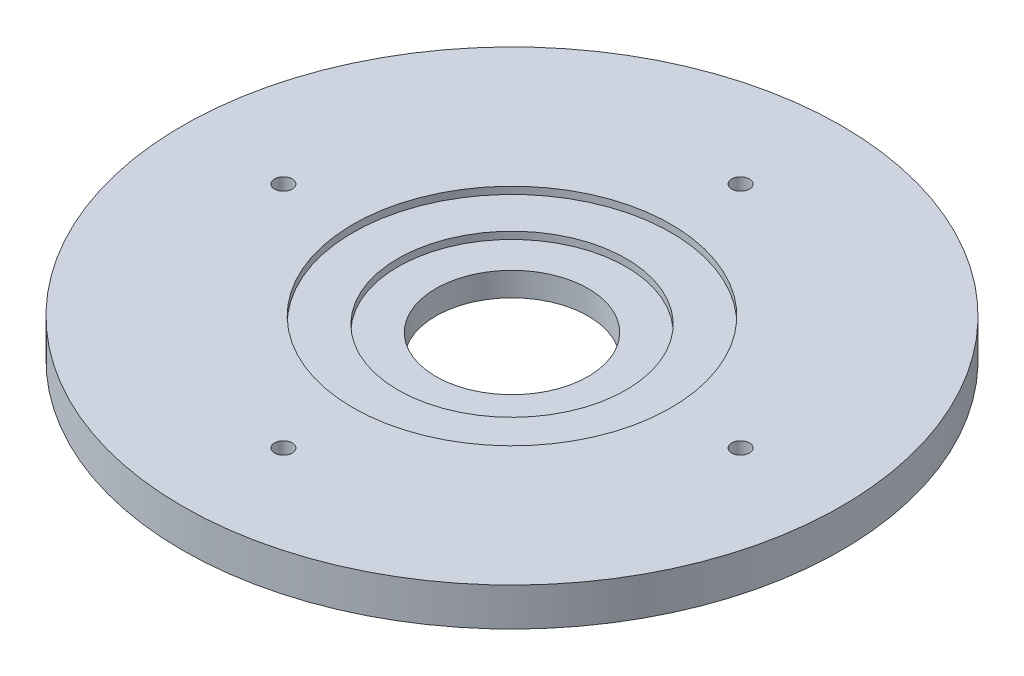
ISO-10303-21;
HEADER;
FILE_DESCRIPTION(('STEP AP214'),'2;1');
FILE_NAME('part.step','',(''),(''),'','','');
FILE_SCHEMA(('AUTOMOTIVE_DESIGN { 1 0 10303 214 1 1 1 1 }'));
ENDSEC;
DATA;
#1=APPLICATION_CONTEXT('core data for automotive mechanical design processes');
#2=APPLICATION_PROTOCOL_DEFINITION('international standard','automotive_design',2000,#1);
#3=PRODUCT_CONTEXT('',#1,'mechanical');
#4=PRODUCT('Part','Part','',(#3));
#5=PRODUCT_RELATED_PRODUCT_CATEGORY('part','',(#4));
#6=PRODUCT_DEFINITION_FORMATION('','',#4);
#7=PRODUCT_DEFINITION_CONTEXT('part definition',#1,'design');
#8=PRODUCT_DEFINITION('design','',#6,#7);
#9=PRODUCT_DEFINITION_SHAPE('','',#8);
#10=(LENGTH_UNIT() NAMED_UNIT(*) SI_UNIT(.MILLI.,.METRE.));
#11=(NAMED_UNIT(*) PLANE_ANGLE_UNIT() SI_UNIT($,.RADIAN.));
#12=(NAMED_UNIT(*) SI_UNIT($,.STERADIAN.) SOLID_ANGLE_UNIT());
#13=UNCERTAINTY_MEASURE_WITH_UNIT(LENGTH_MEASURE(1.E-05),#10,'distance_accuracy_value','');
#14=(GEOMETRIC_REPRESENTATION_CONTEXT(3) GLOBAL_UNCERTAINTY_ASSIGNED_CONTEXT((#13)) GLOBAL_UNIT_ASSIGNED_CONTEXT((#10,
#11,#12)) REPRESENTATION_CONTEXT('',''));
#15=CARTESIAN_POINT('',(0.,0.,0.));
#16=DIRECTION('',(0.,0.,1.));
#17=DIRECTION('',(1.,0.,0.));
#18=AXIS2_PLACEMENT_3D('',#15,#16,#17);
#19=CARTESIAN_POINT('',(0.,6.35,0.));
#20=DIRECTION('',(0.,-1.,0.));
#21=DIRECTION('',(0.,0.,-1.));
#22=AXIS2_PLACEMENT_3D('',#19,#20,#21);
#23=CYLINDRICAL_SURFACE('',#22,12.7);
#24=CARTESIAN_POINT('',(0.,0.,0.));
#25=DIRECTION('',(0.,1.,0.));
#26=DIRECTION('',(0.,0.,1.));
#27=AXIS2_PLACEMENT_3D('',#24,#25,#26);
#28=CIRCLE('',#27,12.7);
#29=CARTESIAN_POINT('',(0.,0.,12.7));
#30=VERTEX_POINT('',#29);
#31=EDGE_CURVE('E44',#30,#30,#28,.T.);
#32=ORIENTED_EDGE('',*,*,#31,.F.);
#33=EDGE_LOOP('',(#32));
#34=FACE_BOUND('',#33,.T.);
#35=CARTESIAN_POINT('',(0.,3.96875,0.));
#36=DIRECTION('',(0.,1.,0.));
#37=DIRECTION('',(0.,0.,1.));
#38=AXIS2_PLACEMENT_3D('',#35,#36,#37);
#39=CIRCLE('',#38,12.7);
#40=CARTESIAN_POINT('',(0.,3.96875,12.7));
#41=VERTEX_POINT('',#40);
#42=EDGE_CURVE('E35',#41,#41,#39,.T.);
#43=ORIENTED_EDGE('',*,*,#42,.T.);
#44=EDGE_LOOP('',(#43));
#45=FACE_BOUND('',#44,.T.);
#46=ADVANCED_FACE('F31',(#34,#45),#23,.F.);
#47=CARTESIAN_POINT('',(0.,6.35,0.));
#48=DIRECTION('',(0.,1.,0.));
#49=DIRECTION('',(0.,0.,1.));
#50=AXIS2_PLACEMENT_3D('',#47,#48,#49);
#51=PLANE('',#50);
#52=CARTESIAN_POINT('',(0.,6.35,38.1));
#53=DIRECTION('',(0.,1.,0.));
#54=DIRECTION('',(0.,0.,1.));
#55=AXIS2_PLACEMENT_3D('',#52,#53,#54);
#56=CIRCLE('',#55,1.4732);
#57=CARTESIAN_POINT('',(0.,6.35,39.5732));
#58=VERTEX_POINT('',#57);
#59=EDGE_CURVE('E123',#58,#58,#56,.T.);
#60=ORIENTED_EDGE('',*,*,#59,.F.);
#61=EDGE_LOOP('',(#60));
#62=FACE_BOUND('',#61,.T.);
#63=CARTESIAN_POINT('',(-38.1,6.35,0.));
#64=DIRECTION('',(0.,1.,0.));
#65=DIRECTION('',(0.,0.,1.));
#66=AXIS2_PLACEMENT_3D('',#63,#64,#65);
#67=CIRCLE('',#66,1.4732);
#68=CARTESIAN_POINT('',(-38.1,6.35,1.4732));
#69=VERTEX_POINT('',#68);
#70=EDGE_CURVE('E125',#69,#69,#67,.T.);
#71=ORIENTED_EDGE('',*,*,#70,.F.);
#72=EDGE_LOOP('',(#71));
#73=FACE_BOUND('',#72,.T.);
#74=CARTESIAN_POINT('',(0.,6.35,-38.1));
#75=DIRECTION('',(0.,1.,0.));
#76=DIRECTION('',(0.,0.,1.));
#77=AXIS2_PLACEMENT_3D('',#74,#75,#76);
#78=CIRCLE('',#77,1.4732);
#79=CARTESIAN_POINT('',(0.,6.35,-36.6268));
#80=VERTEX_POINT('',#79);
#81=EDGE_CURVE('E131',#80,#80,#78,.T.);
#82=ORIENTED_EDGE('',*,*,#81,.F.);
#83=EDGE_LOOP('',(#82));
#84=FACE_BOUND('',#83,.T.);
#85=CARTESIAN_POINT('',(38.1,6.35,0.));
#86=DIRECTION('',(0.,1.,0.));
#87=DIRECTION('',(0.,0.,1.));
#88=AXIS2_PLACEMENT_3D('',#85,#86,#87);
#89=CIRCLE('',#88,1.4732);
#90=CARTESIAN_POINT('',(38.1,6.35,1.4732));
#91=VERTEX_POINT('',#90);
#92=EDGE_CURVE('E61',#91,#91,#89,.T.);
#93=ORIENTED_EDGE('',*,*,#92,.F.);
#94=EDGE_LOOP('',(#93));
#95=FACE_BOUND('',#94,.T.);
#96=CARTESIAN_POINT('',(0.,6.35,0.));
#97=DIRECTION('',(0.,1.,0.));
#98=DIRECTION('',(0.,0.,1.));
#99=AXIS2_PLACEMENT_3D('',#96,#97,#98);
#100=CIRCLE('',#99,26.5);
#101=CARTESIAN_POINT('',(0.,6.35,26.5));
#102=VERTEX_POINT('',#101);
#103=EDGE_CURVE('E54',#102,#102,#100,.T.);
#104=ORIENTED_EDGE('',*,*,#103,.F.);
#105=EDGE_LOOP('',(#104));
#106=FACE_BOUND('',#105,.T.);
#107=CARTESIAN_POINT('',(0.,6.35,0.));
#108=DIRECTION('',(0.,1.,0.));
#109=DIRECTION('',(0.,0.,1.));
#110=AXIS2_PLACEMENT_3D('',#107,#108,#109);
#111=CIRCLE('',#110,54.9275);
#112=CARTESIAN_POINT('',(0.,6.35,54.9275));
#113=VERTEX_POINT('',#112);
#114=EDGE_CURVE('E10',#113,#113,#111,.T.);
#115=ORIENTED_EDGE('',*,*,#114,.T.);
#116=EDGE_LOOP('',(#115));
#117=FACE_BOUND('',#116,.T.);
#118=ADVANCED_FACE('F72',(#62,#73,#84,#95,#106,#117),#51,.T.);
#119=CARTESIAN_POINT('',(0.,0.,0.));
#120=DIRECTION('',(0.,1.,0.));
#121=DIRECTION('',(0.,0.,1.));
#122=AXIS2_PLACEMENT_3D('',#119,#120,#121);
#123=PLANE('',#122);
#124=CARTESIAN_POINT('',(0.,0.,38.1));
#125=DIRECTION('',(0.,1.,0.));
#126=DIRECTION('',(0.,0.,1.));
#127=AXIS2_PLACEMENT_3D('',#124,#125,#126);
#128=CIRCLE('',#127,1.4732);
#129=CARTESIAN_POINT('',(0.,0.,39.5732));
#130=VERTEX_POINT('',#129);
#131=EDGE_CURVE('E121',#130,#130,#128,.T.);
#132=ORIENTED_EDGE('',*,*,#131,.T.);
#133=EDGE_LOOP('',(#132));
#134=FACE_BOUND('',#133,.T.);
#135=CARTESIAN_POINT('',(-38.1,0.,0.));
#136=DIRECTION('',(0.,1.,0.));
#137=DIRECTION('',(0.,0.,1.));
#138=AXIS2_PLACEMENT_3D('',#135,#136,#137);
#139=CIRCLE('',#138,1.4732);
#140=CARTESIAN_POINT('',(-38.1,0.,1.4732));
#141=VERTEX_POINT('',#140);
#142=EDGE_CURVE('E128',#141,#141,#139,.T.);
#143=ORIENTED_EDGE('',*,*,#142,.T.);
#144=EDGE_LOOP('',(#143));
#145=FACE_BOUND('',#144,.T.);
#146=CARTESIAN_POINT('',(0.,0.,-38.1));
#147=DIRECTION('',(0.,1.,0.));
#148=DIRECTION('',(0.,0.,1.));
#149=AXIS2_PLACEMENT_3D('',#146,#147,#148);
#150=CIRCLE('',#149,1.4732);
#151=CARTESIAN_POINT('',(0.,0.,-36.6268));
#152=VERTEX_POINT('',#151);
#153=EDGE_CURVE('E134',#152,#152,#150,.T.);
#154=ORIENTED_EDGE('',*,*,#153,.T.);
#155=EDGE_LOOP('',(#154));
#156=FACE_BOUND('',#155,.T.);
#157=CARTESIAN_POINT('',(38.1,0.,0.));
#158=DIRECTION('',(0.,1.,0.));
#159=DIRECTION('',(0.,0.,1.));
#160=AXIS2_PLACEMENT_3D('',#157,#158,#159);
#161=CIRCLE('',#160,1.4732);
#162=CARTESIAN_POINT('',(38.1,0.,1.4732));
#163=VERTEX_POINT('',#162);
#164=EDGE_CURVE('E56',#163,#163,#161,.T.);
#165=ORIENTED_EDGE('',*,*,#164,.T.);
#166=EDGE_LOOP('',(#165));
#167=FACE_BOUND('',#166,.T.);
#168=CARTESIAN_POINT('',(0.,0.,0.));
#169=DIRECTION('',(0.,1.,0.));
#170=DIRECTION('',(0.,0.,1.));
#171=AXIS2_PLACEMENT_3D('',#168,#169,#170);
#172=CIRCLE('',#171,54.9275);
#173=CARTESIAN_POINT('',(0.,0.,54.9275));
#174=VERTEX_POINT('',#173);
#175=EDGE_CURVE('E39',#174,#174,#172,.T.);
#176=ORIENTED_EDGE('',*,*,#175,.F.);
#177=EDGE_LOOP('',(#176));
#178=FACE_BOUND('',#177,.T.);
#179=ORIENTED_EDGE('',*,*,#31,.T.);
#180=EDGE_LOOP('',(#179));
#181=FACE_BOUND('',#180,.T.);
#182=ADVANCED_FACE('F74',(#134,#145,#156,#167,#178,#181),#123,.F.);
#183=CARTESIAN_POINT('',(0.,6.35,0.));
#184=DIRECTION('',(0.,-1.,0.));
#185=DIRECTION('',(0.,0.,-1.));
#186=AXIS2_PLACEMENT_3D('',#183,#184,#185);
#187=CYLINDRICAL_SURFACE('',#186,54.9275);
#188=ORIENTED_EDGE('',*,*,#114,.F.);
#189=EDGE_LOOP('',(#188));
#190=FACE_BOUND('',#189,.T.);
#191=ORIENTED_EDGE('',*,*,#175,.T.);
#192=EDGE_LOOP('',(#191));
#193=FACE_BOUND('',#192,.T.);
#194=ADVANCED_FACE('F33',(#190,#193),#187,.T.);
#195=CARTESIAN_POINT('',(0.,5.159375,0.));
#196=DIRECTION('',(0.,1.,0.));
#197=DIRECTION('',(0.,0.,1.));
#198=AXIS2_PLACEMENT_3D('',#195,#196,#197);
#199=CYLINDRICAL_SURFACE('',#198,26.5);
#200=CARTESIAN_POINT('',(0.,5.159375,0.));
#201=DIRECTION('',(0.,1.,0.));
#202=DIRECTION('',(0.,0.,1.));
#203=AXIS2_PLACEMENT_3D('',#200,#201,#202);
#204=CIRCLE('',#203,26.5);
#205=CARTESIAN_POINT('',(0.,5.159375,26.5));
#206=VERTEX_POINT('',#205);
#207=EDGE_CURVE('E65',#206,#206,#204,.T.);
#208=ORIENTED_EDGE('',*,*,#207,.F.);
#209=EDGE_LOOP('',(#208));
#210=FACE_BOUND('',#209,.T.);
#211=ORIENTED_EDGE('',*,*,#103,.T.);
#212=EDGE_LOOP('',(#211));
#213=FACE_BOUND('',#212,.T.);
#214=ADVANCED_FACE('F70',(#210,#213),#199,.F.);
#215=CARTESIAN_POINT('',(0.,5.159375,0.));
#216=DIRECTION('',(0.,1.,0.));
#217=DIRECTION('',(0.,0.,1.));
#218=AXIS2_PLACEMENT_3D('',#215,#216,#217);
#219=PLANE('',#218);
#220=CARTESIAN_POINT('',(0.,5.159375,0.));
#221=DIRECTION('',(0.,1.,0.));
#222=DIRECTION('',(0.,0.,1.));
#223=AXIS2_PLACEMENT_3D('',#220,#221,#222);
#224=CIRCLE('',#223,19.);
#225=CARTESIAN_POINT('',(0.,5.159375,19.));
#226=VERTEX_POINT('',#225);
#227=EDGE_CURVE('E48',#226,#226,#224,.T.);
#228=ORIENTED_EDGE('',*,*,#227,.F.);
#229=EDGE_LOOP('',(#228));
#230=FACE_BOUND('',#229,.T.);
#231=ORIENTED_EDGE('',*,*,#207,.T.);
#232=EDGE_LOOP('',(#231));
#233=FACE_BOUND('',#232,.T.);
#234=ADVANCED_FACE('F89',(#230,#233),#219,.T.);
#235=CARTESIAN_POINT('',(0.,3.96875,0.));
#236=DIRECTION('',(0.,1.,0.));
#237=DIRECTION('',(0.,0.,1.));
#238=AXIS2_PLACEMENT_3D('',#235,#236,#237);
#239=CYLINDRICAL_SURFACE('',#238,19.);
#240=ORIENTED_EDGE('',*,*,#227,.T.);
#241=EDGE_LOOP('',(#240));
#242=FACE_BOUND('',#241,.T.);
#243=CARTESIAN_POINT('',(0.,3.96875,0.));
#244=DIRECTION('',(0.,1.,0.));
#245=DIRECTION('',(0.,0.,1.));
#246=AXIS2_PLACEMENT_3D('',#243,#244,#245);
#247=CIRCLE('',#246,19.);
#248=CARTESIAN_POINT('',(0.,3.96875,19.));
#249=VERTEX_POINT('',#248);
#250=EDGE_CURVE('E50',#249,#249,#247,.T.);
#251=ORIENTED_EDGE('',*,*,#250,.F.);
#252=EDGE_LOOP('',(#251));
#253=FACE_BOUND('',#252,.T.);
#254=ADVANCED_FACE('F93',(#242,#253),#239,.F.);
#255=CARTESIAN_POINT('',(0.,3.96875,0.));
#256=DIRECTION('',(0.,1.,0.));
#257=DIRECTION('',(0.,0.,1.));
#258=AXIS2_PLACEMENT_3D('',#255,#256,#257);
#259=PLANE('',#258);
#260=ORIENTED_EDGE('',*,*,#42,.F.);
#261=EDGE_LOOP('',(#260));
#262=FACE_BOUND('',#261,.T.);
#263=ORIENTED_EDGE('',*,*,#250,.T.);
#264=EDGE_LOOP('',(#263));
#265=FACE_BOUND('',#264,.T.);
#266=ADVANCED_FACE('F97',(#262,#265),#259,.T.);
#267=CARTESIAN_POINT('',(38.1,0.,0.));
#268=DIRECTION('',(0.,1.,0.));
#269=DIRECTION('',(0.,0.,1.));
#270=AXIS2_PLACEMENT_3D('',#267,#268,#269);
#271=CYLINDRICAL_SURFACE('',#270,1.4732);
#272=ORIENTED_EDGE('',*,*,#164,.F.);
#273=EDGE_LOOP('',(#272));
#274=FACE_BOUND('',#273,.T.);
#275=ORIENTED_EDGE('',*,*,#92,.T.);
#276=EDGE_LOOP('',(#275));
#277=FACE_BOUND('',#276,.T.);
#278=ADVANCED_FACE('F100',(#274,#277),#271,.F.);
#279=CARTESIAN_POINT('',(0.,0.,-38.1));
#280=DIRECTION('',(0.,1.,0.));
#281=DIRECTION('',(0.,0.,1.));
#282=AXIS2_PLACEMENT_3D('',#279,#280,#281);
#283=CYLINDRICAL_SURFACE('',#282,1.4732);
#284=ORIENTED_EDGE('',*,*,#153,.F.);
#285=EDGE_LOOP('',(#284));
#286=FACE_BOUND('',#285,.T.);
#287=ORIENTED_EDGE('',*,*,#81,.T.);
#288=EDGE_LOOP('',(#287));
#289=FACE_BOUND('',#288,.T.);
#290=ADVANCED_FACE('F104',(#286,#289),#283,.F.);
#291=CARTESIAN_POINT('',(-38.1,0.,0.));
#292=DIRECTION('',(0.,1.,0.));
#293=DIRECTION('',(0.,0.,1.));
#294=AXIS2_PLACEMENT_3D('',#291,#292,#293);
#295=CYLINDRICAL_SURFACE('',#294,1.4732);
#296=ORIENTED_EDGE('',*,*,#142,.F.);
#297=EDGE_LOOP('',(#296));
#298=FACE_BOUND('',#297,.T.);
#299=ORIENTED_EDGE('',*,*,#70,.T.);
#300=EDGE_LOOP('',(#299));
#301=FACE_BOUND('',#300,.T.);
#302=ADVANCED_FACE('F108',(#298,#301),#295,.F.);
#303=CARTESIAN_POINT('',(0.,0.,38.1));
#304=DIRECTION('',(0.,1.,0.));
#305=DIRECTION('',(0.,0.,1.));
#306=AXIS2_PLACEMENT_3D('',#303,#304,#305);
#307=CYLINDRICAL_SURFACE('',#306,1.4732);
#308=ORIENTED_EDGE('',*,*,#131,.F.);
#309=EDGE_LOOP('',(#308));
#310=FACE_BOUND('',#309,.T.);
#311=ORIENTED_EDGE('',*,*,#59,.T.);
#312=EDGE_LOOP('',(#311));
#313=FACE_BOUND('',#312,.T.);
#314=ADVANCED_FACE('F112',(#310,#313),#307,.F.);
#315=CLOSED_SHELL('',(#46,#118,#182,#194,#214,#234,#254,#266,#278,#290,#302,#314));
#316=MANIFOLD_SOLID_BREP('B2',#315);
#317=ADVANCED_BREP_SHAPE_REPRESENTATION('',(#18,#316),#14);
#318=SHAPE_DEFINITION_REPRESENTATION(#9,#317);
ENDSEC;
END-ISO-10303-21;
